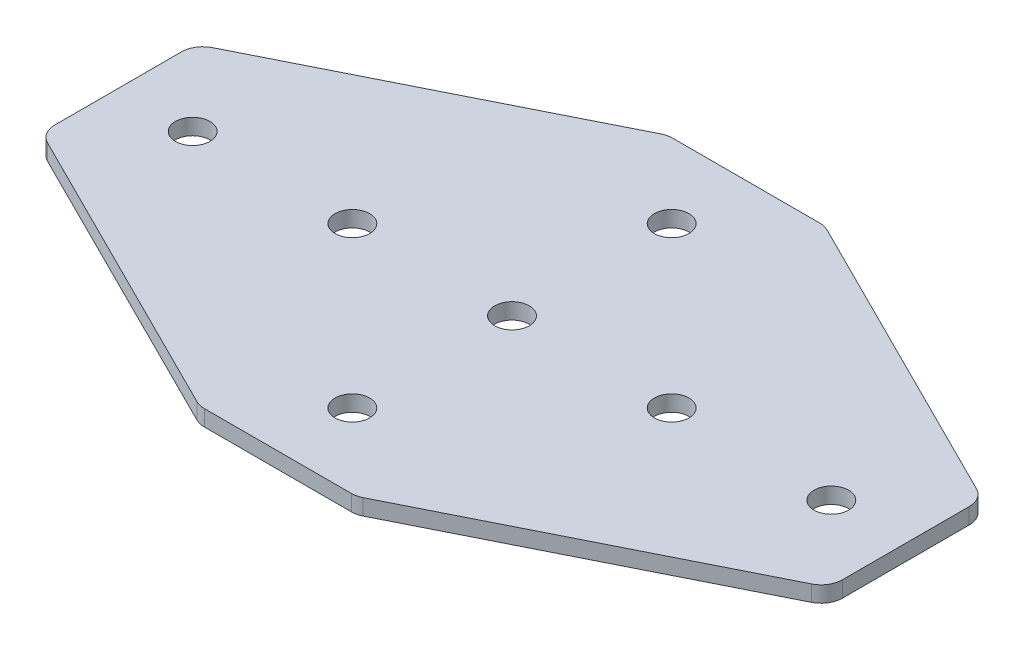
ISO-10303-21;
HEADER;
FILE_DESCRIPTION(('STEP AP214'),'2;1');
FILE_NAME('part.step','',(''),(''),'','','');
FILE_SCHEMA(('AUTOMOTIVE_DESIGN { 1 0 10303 214 1 1 1 1 }'));
ENDSEC;
DATA;
#1=APPLICATION_CONTEXT('core data for automotive mechanical design processes');
#2=APPLICATION_PROTOCOL_DEFINITION('international standard','automotive_design',2000,#1);
#3=PRODUCT_CONTEXT('',#1,'mechanical');
#4=PRODUCT('Part','Part','',(#3));
#5=PRODUCT_RELATED_PRODUCT_CATEGORY('part','',(#4));
#6=PRODUCT_DEFINITION_FORMATION('','',#4);
#7=PRODUCT_DEFINITION_CONTEXT('part definition',#1,'design');
#8=PRODUCT_DEFINITION('design','',#6,#7);
#9=PRODUCT_DEFINITION_SHAPE('','',#8);
#10=(LENGTH_UNIT() NAMED_UNIT(*) SI_UNIT(.MILLI.,.METRE.));
#11=(NAMED_UNIT(*) PLANE_ANGLE_UNIT() SI_UNIT($,.RADIAN.));
#12=(NAMED_UNIT(*) SI_UNIT($,.STERADIAN.) SOLID_ANGLE_UNIT());
#13=UNCERTAINTY_MEASURE_WITH_UNIT(LENGTH_MEASURE(1.E-05),#10,'distance_accuracy_value','');
#14=(GEOMETRIC_REPRESENTATION_CONTEXT(3) GLOBAL_UNCERTAINTY_ASSIGNED_CONTEXT((#13)) GLOBAL_UNIT_ASSIGNED_CONTEXT((#10,
#11,#12)) REPRESENTATION_CONTEXT('',''));
#15=CARTESIAN_POINT('',(0.,0.,0.));
#16=DIRECTION('',(0.,0.,1.));
#17=DIRECTION('',(1.,0.,0.));
#18=AXIS2_PLACEMENT_3D('',#15,#16,#17);
#19=CARTESIAN_POINT('',(-0.674094842111117,1.52470932668439,-1.60024481073151));
#20=DIRECTION('',(0.,-1.,0.));
#21=DIRECTION('',(0.,0.,-1.));
#22=AXIS2_PLACEMENT_3D('',#19,#20,#21);
#23=PLANE('',#22);
#24=CARTESIAN_POINT('',(-15.6740948421111,1.52470932668439,-1.6002448107315));
#25=DIRECTION('',(0.,-1.,0.));
#26=DIRECTION('',(0.,0.,1.));
#27=AXIS2_PLACEMENT_3D('',#24,#25,#26);
#28=CIRCLE('',#27,1.625);
#29=CARTESIAN_POINT('',(-15.6740948421111,1.52470932668439,0.0247551892685041));
#30=VERTEX_POINT('',#29);
#31=EDGE_CURVE('E175',#30,#30,#28,.T.);
#32=ORIENTED_EDGE('',*,*,#31,.F.);
#33=EDGE_LOOP('',(#32));
#34=FACE_BOUND('',#33,.T.);
#35=CARTESIAN_POINT('',(-30.6740948421111,1.52470932668439,-1.60024481073149));
#36=DIRECTION('',(0.,-1.,0.));
#37=DIRECTION('',(0.,0.,1.));
#38=AXIS2_PLACEMENT_3D('',#35,#36,#37);
#39=CIRCLE('',#38,1.625);
#40=CARTESIAN_POINT('',(-30.6740948421111,1.52470932668439,0.024755189268511));
#41=VERTEX_POINT('',#40);
#42=EDGE_CURVE('E168',#41,#41,#39,.T.);
#43=ORIENTED_EDGE('',*,*,#42,.F.);
#44=EDGE_LOOP('',(#43));
#45=FACE_BOUND('',#44,.T.);
#46=CARTESIAN_POINT('',(-0.674094842111117,1.52470932668439,-1.60024481073151));
#47=DIRECTION('',(0.,1.,0.));
#48=DIRECTION('',(0.,0.,1.));
#49=AXIS2_PLACEMENT_3D('',#46,#47,#48);
#50=CIRCLE('',#49,1.625);
#51=CARTESIAN_POINT('',(-0.674094842111117,1.52470932668439,0.0247551892684898));
#52=VERTEX_POINT('',#51);
#53=EDGE_CURVE('E210',#52,#52,#50,.T.);
#54=ORIENTED_EDGE('',*,*,#53,.T.);
#55=EDGE_LOOP('',(#54));
#56=FACE_BOUND('',#55,.T.);
#57=DIRECTION('',(1.,0.,0.));
#58=VECTOR('',#57,1.);
#59=CARTESIAN_POINT('',(-7.67409484211121,1.52470932668439,-23.6002448107315));
#60=LINE('',#59,#58);
#61=CARTESIAN_POINT('',(-7.58392489836175,1.52470932668439,-23.6002448107315));
#62=VERTEX_POINT('',#61);
#63=CARTESIAN_POINT('',(6.23573521413951,1.52470932668439,-23.6002448107315));
#64=VERTEX_POINT('',#63);
#65=EDGE_CURVE('E159',#62,#64,#60,.T.);
#66=ORIENTED_EDGE('',*,*,#65,.T.);
#67=CARTESIAN_POINT('',(6.23573521413951,1.52470932668439,-21.6002448107315));
#68=DIRECTION('',(0.,-1.,0.));
#69=DIRECTION('',(0.,0.,-1.));
#70=AXIS2_PLACEMENT_3D('',#67,#68,#69);
#71=CIRCLE('',#70,2.);
#72=CARTESIAN_POINT('',(7.13016240513943,1.52470932668439,-23.3890991927313));
#73=VERTEX_POINT('',#72);
#74=EDGE_CURVE('E260',#64,#73,#71,.T.);
#75=ORIENTED_EDGE('',*,*,#74,.T.);
#76=DIRECTION('',(0.894427190999916,0.,0.447213595499959));
#77=VECTOR('',#76,1.);
#78=CARTESIAN_POINT('',(6.70787116913909,1.52470932668439,-23.6002448107315));
#79=LINE('',#78,#77);
#80=CARTESIAN_POINT('',(35.2203323488887,1.52470932668439,-9.34401422085664));
#81=VERTEX_POINT('',#80);
#82=EDGE_CURVE('E151',#73,#81,#79,.T.);
#83=ORIENTED_EDGE('',*,*,#82,.T.);
#84=CARTESIAN_POINT('',(34.3259051578888,1.52470932668439,-7.55515983885681));
#85=DIRECTION('',(0.,-1.,0.));
#86=DIRECTION('',(0.,0.,-1.));
#87=AXIS2_PLACEMENT_3D('',#84,#85,#86);
#88=CIRCLE('',#87,2.);
#89=CARTESIAN_POINT('',(36.3259051578888,1.52470932668439,-7.55515983885681));
#90=VERTEX_POINT('',#89);
#91=EDGE_CURVE('E253',#81,#90,#88,.T.);
#92=ORIENTED_EDGE('',*,*,#91,.T.);
#93=DIRECTION('',(0.,0.,-1.));
#94=VECTOR('',#93,1.);
#95=CARTESIAN_POINT('',(36.3259051578888,1.52470932668439,5.59073819489358));
#96=LINE('',#95,#94);
#97=CARTESIAN_POINT('',(36.3259051578888,1.52470932668439,4.3546702173938));
#98=VERTEX_POINT('',#97);
#99=EDGE_CURVE('E223',#98,#90,#96,.T.);
#100=ORIENTED_EDGE('',*,*,#99,.F.);
#101=CARTESIAN_POINT('',(34.3259051578888,1.52470932668439,4.3546702173938));
#102=DIRECTION('',(0.,-1.,0.));
#103=DIRECTION('',(0.,0.,-1.));
#104=AXIS2_PLACEMENT_3D('',#101,#102,#103);
#105=CIRCLE('',#104,2.);
#106=CARTESIAN_POINT('',(35.2203323488887,1.52470932668439,6.14352459939363));
#107=VERTEX_POINT('',#106);
#108=EDGE_CURVE('E251',#98,#107,#105,.T.);
#109=ORIENTED_EDGE('',*,*,#108,.T.);
#110=DIRECTION('',(0.894427190999916,0.,-0.447213595499959));
#111=VECTOR('',#110,1.);
#112=CARTESIAN_POINT('',(6.70787116913909,1.52470932668439,20.3997551892685));
#113=LINE('',#112,#111);
#114=CARTESIAN_POINT('',(7.13016240513943,1.52470932668439,20.1886095712683));
#115=VERTEX_POINT('',#114);
#116=EDGE_CURVE('E219',#115,#107,#113,.T.);
#117=ORIENTED_EDGE('',*,*,#116,.F.);
#118=CARTESIAN_POINT('',(6.23573521413951,1.52470932668439,18.3997551892685));
#119=DIRECTION('',(0.,-1.,0.));
#120=DIRECTION('',(0.,0.,-1.));
#121=AXIS2_PLACEMENT_3D('',#118,#119,#120);
#122=CIRCLE('',#121,2.);
#123=CARTESIAN_POINT('',(6.23573521413951,1.52470932668439,20.3997551892685));
#124=VERTEX_POINT('',#123);
#125=EDGE_CURVE('E249',#115,#124,#122,.T.);
#126=ORIENTED_EDGE('',*,*,#125,.T.);
#127=DIRECTION('',(1.,0.,0.));
#128=VECTOR('',#127,1.);
#129=CARTESIAN_POINT('',(-7.67409484211121,1.52470932668439,20.3997551892685));
#130=LINE('',#129,#128);
#131=CARTESIAN_POINT('',(-7.58392489836175,1.52470932668439,20.3997551892685));
#132=VERTEX_POINT('',#131);
#133=EDGE_CURVE('E216',#132,#124,#130,.T.);
#134=ORIENTED_EDGE('',*,*,#133,.F.);
#135=CARTESIAN_POINT('',(-7.58392489836175,1.52470932668439,18.3997551892685));
#136=DIRECTION('',(0.,-1.,0.));
#137=DIRECTION('',(0.,0.,-1.));
#138=AXIS2_PLACEMENT_3D('',#135,#136,#137);
#139=CIRCLE('',#138,2.);
#140=CARTESIAN_POINT('',(-8.47835208936166,1.52470932668439,20.1886095712683));
#141=VERTEX_POINT('',#140);
#142=EDGE_CURVE('E247',#132,#141,#139,.T.);
#143=ORIENTED_EDGE('',*,*,#142,.T.);
#144=DIRECTION('',(-0.894427190999916,0.,-0.447213595499958));
#145=VECTOR('',#144,1.);
#146=CARTESIAN_POINT('',(-8.05606085336131,1.52470932668439,20.3997551892685));
#147=LINE('',#146,#145);
#148=CARTESIAN_POINT('',(-36.5685220331109,1.52470932668439,6.14352459939364));
#149=VERTEX_POINT('',#148);
#150=EDGE_CURVE('E181',#141,#149,#147,.T.);
#151=ORIENTED_EDGE('',*,*,#150,.T.);
#152=CARTESIAN_POINT('',(-35.674094842111,1.52470932668439,4.3546702173938));
#153=DIRECTION('',(0.,-1.,0.));
#154=DIRECTION('',(0.,0.,-1.));
#155=AXIS2_PLACEMENT_3D('',#152,#153,#154);
#156=CIRCLE('',#155,2.);
#157=CARTESIAN_POINT('',(-37.674094842111,1.52470932668439,4.35467021739381));
#158=VERTEX_POINT('',#157);
#159=EDGE_CURVE('E255',#149,#158,#156,.T.);
#160=ORIENTED_EDGE('',*,*,#159,.T.);
#161=DIRECTION('',(0.,0.,-1.));
#162=VECTOR('',#161,1.);
#163=CARTESIAN_POINT('',(-37.674094842111,1.52470932668439,5.59073819489359));
#164=LINE('',#163,#162);
#165=CARTESIAN_POINT('',(-37.674094842111,1.52470932668439,-7.55515983885682));
#166=VERTEX_POINT('',#165);
#167=EDGE_CURVE('E184',#158,#166,#164,.T.);
#168=ORIENTED_EDGE('',*,*,#167,.T.);
#169=CARTESIAN_POINT('',(-35.674094842111,1.52470932668439,-7.55515983885682));
#170=DIRECTION('',(0.,-1.,0.));
#171=DIRECTION('',(0.,0.,-1.));
#172=AXIS2_PLACEMENT_3D('',#169,#170,#171);
#173=CIRCLE('',#172,2.);
#174=CARTESIAN_POINT('',(-36.568522033111,1.52470932668439,-9.34401422085665));
#175=VERTEX_POINT('',#174);
#176=EDGE_CURVE('E31',#166,#175,#173,.T.);
#177=ORIENTED_EDGE('',*,*,#176,.T.);
#178=DIRECTION('',(-0.894427190999916,0.,0.447213595499958));
#179=VECTOR('',#178,1.);
#180=CARTESIAN_POINT('',(-8.05606085336131,1.52470932668439,-23.6002448107315));
#181=LINE('',#180,#179);
#182=CARTESIAN_POINT('',(-8.47835208936166,1.52470932668439,-23.3890991927313));
#183=VERTEX_POINT('',#182);
#184=EDGE_CURVE('E317',#183,#175,#181,.T.);
#185=ORIENTED_EDGE('',*,*,#184,.F.);
#186=CARTESIAN_POINT('',(-7.58392489836175,1.52470932668439,-21.6002448107315));
#187=DIRECTION('',(0.,-1.,0.));
#188=DIRECTION('',(0.,0.,-1.));
#189=AXIS2_PLACEMENT_3D('',#186,#187,#188);
#190=CIRCLE('',#189,2.);
#191=EDGE_CURVE('E258',#183,#62,#190,.T.);
#192=ORIENTED_EDGE('',*,*,#191,.T.);
#193=EDGE_LOOP('',(#66,#75,#83,#92,#100,#109,#117,#126,#134,#143,#151,#160,#168,#177,#185,#192));
#194=FACE_BOUND('',#193,.T.);
#195=CARTESIAN_POINT('',(29.3259051578889,1.52470932668439,-1.6002448107315));
#196=DIRECTION('',(0.,1.,0.));
#197=DIRECTION('',(0.,0.,1.));
#198=AXIS2_PLACEMENT_3D('',#195,#196,#197);
#199=CIRCLE('',#198,1.625);
#200=CARTESIAN_POINT('',(29.3259051578889,1.52470932668439,0.0247551892685039));
#201=VERTEX_POINT('',#200);
#202=EDGE_CURVE('E192',#201,#201,#199,.T.);
#203=ORIENTED_EDGE('',*,*,#202,.T.);
#204=EDGE_LOOP('',(#203));
#205=FACE_BOUND('',#204,.T.);
#206=CARTESIAN_POINT('',(-0.674094842111127,1.52470932668439,13.3997551892685));
#207=DIRECTION('',(0.,1.,0.));
#208=DIRECTION('',(0.,0.,1.));
#209=AXIS2_PLACEMENT_3D('',#206,#207,#208);
#210=CIRCLE('',#209,1.625);
#211=CARTESIAN_POINT('',(-0.674094842111127,1.52470932668439,15.0247551892685));
#212=VERTEX_POINT('',#211);
#213=EDGE_CURVE('E198',#212,#212,#210,.T.);
#214=ORIENTED_EDGE('',*,*,#213,.T.);
#215=EDGE_LOOP('',(#214));
#216=FACE_BOUND('',#215,.T.);
#217=CARTESIAN_POINT('',(14.3259051578889,1.52470932668439,-1.6002448107315));
#218=DIRECTION('',(0.,1.,0.));
#219=DIRECTION('',(0.,0.,1.));
#220=AXIS2_PLACEMENT_3D('',#217,#218,#219);
#221=CIRCLE('',#220,1.625);
#222=CARTESIAN_POINT('',(14.3259051578889,1.52470932668439,0.0247551892685004));
#223=VERTEX_POINT('',#222);
#224=EDGE_CURVE('E204',#223,#223,#221,.T.);
#225=ORIENTED_EDGE('',*,*,#224,.T.);
#226=EDGE_LOOP('',(#225));
#227=FACE_BOUND('',#226,.T.);
#228=CARTESIAN_POINT('',(-0.674094842111127,1.52470932668439,-16.6002448107315));
#229=DIRECTION('',(0.,-1.,0.));
#230=DIRECTION('',(0.,0.,-1.));
#231=AXIS2_PLACEMENT_3D('',#228,#229,#230);
#232=CIRCLE('',#231,1.625);
#233=CARTESIAN_POINT('',(-0.674094842111127,1.52470932668439,-18.2252448107315));
#234=VERTEX_POINT('',#233);
#235=EDGE_CURVE('E164',#234,#234,#232,.T.);
#236=ORIENTED_EDGE('',*,*,#235,.F.);
#237=EDGE_LOOP('',(#236));
#238=FACE_BOUND('',#237,.T.);
#239=ADVANCED_FACE('F16',(#34,#45,#56,#194,#205,#216,#227,#238),#23,.T.);
#240=CARTESIAN_POINT('',(36.3259051578888,1.52470932668439,5.59073819489358));
#241=DIRECTION('',(1.,0.,0.));
#242=DIRECTION('',(0.,0.,-1.));
#243=AXIS2_PLACEMENT_3D('',#240,#241,#242);
#244=PLANE('',#243);
#245=ORIENTED_EDGE('',*,*,#99,.T.);
#246=DIRECTION('',(0.,1.,0.));
#247=VECTOR('',#246,1.);
#248=CARTESIAN_POINT('',(36.3259051578888,1.52470932668439,-7.55515983885681));
#249=LINE('',#248,#247);
#250=CARTESIAN_POINT('',(36.3259051578888,3.02470932668439,-7.55515983885681));
#251=VERTEX_POINT('',#250);
#252=EDGE_CURVE('E278',#90,#251,#249,.T.);
#253=ORIENTED_EDGE('',*,*,#252,.T.);
#254=DIRECTION('',(0.,0.,-1.));
#255=VECTOR('',#254,1.);
#256=CARTESIAN_POINT('',(36.3259051578888,3.02470932668439,5.59073819489358));
#257=LINE('',#256,#255);
#258=CARTESIAN_POINT('',(36.3259051578888,3.02470932668439,4.3546702173938));
#259=VERTEX_POINT('',#258);
#260=EDGE_CURVE('E220',#259,#251,#257,.T.);
#261=ORIENTED_EDGE('',*,*,#260,.F.);
#262=DIRECTION('',(0.,1.,0.));
#263=VECTOR('',#262,1.);
#264=CARTESIAN_POINT('',(36.3259051578888,1.52470932668439,4.3546702173938));
#265=LINE('',#264,#263);
#266=EDGE_CURVE('E276',#259,#98,#265,.F.);
#267=ORIENTED_EDGE('',*,*,#266,.T.);
#268=EDGE_LOOP('',(#245,#253,#261,#267));
#269=FACE_BOUND('',#268,.T.);
#270=ADVANCED_FACE('F332',(#269),#244,.T.);
#271=CARTESIAN_POINT('',(-0.674094842111117,3.02470932668439,-1.60024481073151));
#272=DIRECTION('',(0.,-1.,0.));
#273=DIRECTION('',(0.,0.,-1.));
#274=AXIS2_PLACEMENT_3D('',#271,#272,#273);
#275=PLANE('',#274);
#276=CARTESIAN_POINT('',(-15.6740948421111,3.02470932668439,-1.6002448107315));
#277=DIRECTION('',(0.,-1.,0.));
#278=DIRECTION('',(0.,0.,1.));
#279=AXIS2_PLACEMENT_3D('',#276,#277,#278);
#280=CIRCLE('',#279,1.625);
#281=CARTESIAN_POINT('',(-15.6740948421111,3.02470932668439,0.0247551892685041));
#282=VERTEX_POINT('',#281);
#283=EDGE_CURVE('E171',#282,#282,#280,.T.);
#284=ORIENTED_EDGE('',*,*,#283,.T.);
#285=EDGE_LOOP('',(#284));
#286=FACE_BOUND('',#285,.T.);
#287=CARTESIAN_POINT('',(-30.6740948421111,3.02470932668439,-1.60024481073149));
#288=DIRECTION('',(0.,-1.,0.));
#289=DIRECTION('',(0.,0.,1.));
#290=AXIS2_PLACEMENT_3D('',#287,#288,#289);
#291=CIRCLE('',#290,1.625);
#292=CARTESIAN_POINT('',(-30.6740948421111,3.02470932668439,0.024755189268511));
#293=VERTEX_POINT('',#292);
#294=EDGE_CURVE('E172',#293,#293,#291,.T.);
#295=ORIENTED_EDGE('',*,*,#294,.T.);
#296=EDGE_LOOP('',(#295));
#297=FACE_BOUND('',#296,.T.);
#298=CARTESIAN_POINT('',(-0.674094842111117,3.02470932668439,-1.60024481073151));
#299=DIRECTION('',(0.,1.,0.));
#300=DIRECTION('',(0.,0.,1.));
#301=AXIS2_PLACEMENT_3D('',#298,#299,#300);
#302=CIRCLE('',#301,1.625);
#303=CARTESIAN_POINT('',(-0.674094842111117,3.02470932668439,0.0247551892684898));
#304=VERTEX_POINT('',#303);
#305=EDGE_CURVE('E207',#304,#304,#302,.T.);
#306=ORIENTED_EDGE('',*,*,#305,.F.);
#307=EDGE_LOOP('',(#306));
#308=FACE_BOUND('',#307,.T.);
#309=DIRECTION('',(0.894427190999916,0.,0.447213595499959));
#310=VECTOR('',#309,1.);
#311=CARTESIAN_POINT('',(6.70787116913909,3.02470932668439,-23.6002448107315));
#312=LINE('',#311,#310);
#313=CARTESIAN_POINT('',(7.13016240513943,3.02470932668439,-23.3890991927313));
#314=VERTEX_POINT('',#313);
#315=CARTESIAN_POINT('',(35.2203323488887,3.02470932668439,-9.34401422085664));
#316=VERTEX_POINT('',#315);
#317=EDGE_CURVE('E148',#314,#316,#312,.T.);
#318=ORIENTED_EDGE('',*,*,#317,.F.);
#319=CARTESIAN_POINT('',(6.23573521413951,3.02470932668439,-21.6002448107315));
#320=DIRECTION('',(0.,-1.,0.));
#321=DIRECTION('',(0.,0.,-1.));
#322=AXIS2_PLACEMENT_3D('',#319,#320,#321);
#323=CIRCLE('',#322,2.);
#324=CARTESIAN_POINT('',(6.23573521413951,3.02470932668439,-23.6002448107315));
#325=VERTEX_POINT('',#324);
#326=EDGE_CURVE('E131',#314,#325,#323,.F.);
#327=ORIENTED_EDGE('',*,*,#326,.T.);
#328=DIRECTION('',(1.,0.,0.));
#329=VECTOR('',#328,1.);
#330=CARTESIAN_POINT('',(-7.67409484211121,3.02470932668439,-23.6002448107315));
#331=LINE('',#330,#329);
#332=CARTESIAN_POINT('',(-7.58392489836175,3.02470932668439,-23.6002448107315));
#333=VERTEX_POINT('',#332);
#334=EDGE_CURVE('E160',#333,#325,#331,.T.);
#335=ORIENTED_EDGE('',*,*,#334,.F.);
#336=CARTESIAN_POINT('',(-7.58392489836175,3.02470932668439,-21.6002448107315));
#337=DIRECTION('',(0.,-1.,0.));
#338=DIRECTION('',(0.,0.,-1.));
#339=AXIS2_PLACEMENT_3D('',#336,#337,#338);
#340=CIRCLE('',#339,2.);
#341=CARTESIAN_POINT('',(-8.47835208936166,3.02470932668439,-23.3890991927313));
#342=VERTEX_POINT('',#341);
#343=EDGE_CURVE('E142',#333,#342,#340,.F.);
#344=ORIENTED_EDGE('',*,*,#343,.T.);
#345=DIRECTION('',(-0.894427190999916,0.,0.447213595499958));
#346=VECTOR('',#345,1.);
#347=CARTESIAN_POINT('',(-8.05606085336131,3.02470932668439,-23.6002448107315));
#348=LINE('',#347,#346);
#349=CARTESIAN_POINT('',(-36.568522033111,3.02470932668439,-9.34401422085665));
#350=VERTEX_POINT('',#349);
#351=EDGE_CURVE('E316',#342,#350,#348,.T.);
#352=ORIENTED_EDGE('',*,*,#351,.T.);
#353=CARTESIAN_POINT('',(-35.674094842111,3.02470932668439,-7.55515983885682));
#354=DIRECTION('',(0.,-1.,0.));
#355=DIRECTION('',(0.,0.,-1.));
#356=AXIS2_PLACEMENT_3D('',#353,#354,#355);
#357=CIRCLE('',#356,2.);
#358=CARTESIAN_POINT('',(-37.674094842111,3.02470932668439,-7.55515983885682));
#359=VERTEX_POINT('',#358);
#360=EDGE_CURVE('E241',#350,#359,#357,.F.);
#361=ORIENTED_EDGE('',*,*,#360,.T.);
#362=DIRECTION('',(0.,0.,-1.));
#363=VECTOR('',#362,1.);
#364=CARTESIAN_POINT('',(-37.674094842111,3.02470932668439,5.59073819489359));
#365=LINE('',#364,#363);
#366=CARTESIAN_POINT('',(-37.674094842111,3.02470932668439,4.35467021739381));
#367=VERTEX_POINT('',#366);
#368=EDGE_CURVE('E185',#367,#359,#365,.T.);
#369=ORIENTED_EDGE('',*,*,#368,.F.);
#370=CARTESIAN_POINT('',(-35.674094842111,3.02470932668439,4.3546702173938));
#371=DIRECTION('',(0.,-1.,0.));
#372=DIRECTION('',(0.,0.,-1.));
#373=AXIS2_PLACEMENT_3D('',#370,#371,#372);
#374=CIRCLE('',#373,2.);
#375=CARTESIAN_POINT('',(-36.5685220331109,3.02470932668439,6.14352459939364));
#376=VERTEX_POINT('',#375);
#377=EDGE_CURVE('E239',#367,#376,#374,.F.);
#378=ORIENTED_EDGE('',*,*,#377,.T.);
#379=DIRECTION('',(-0.894427190999916,0.,-0.447213595499958));
#380=VECTOR('',#379,1.);
#381=CARTESIAN_POINT('',(-8.05606085336131,3.02470932668439,20.3997551892685));
#382=LINE('',#381,#380);
#383=CARTESIAN_POINT('',(-8.47835208936166,3.02470932668439,20.1886095712683));
#384=VERTEX_POINT('',#383);
#385=EDGE_CURVE('E178',#384,#376,#382,.T.);
#386=ORIENTED_EDGE('',*,*,#385,.F.);
#387=CARTESIAN_POINT('',(-7.58392489836175,3.02470932668439,18.3997551892685));
#388=DIRECTION('',(0.,-1.,0.));
#389=DIRECTION('',(0.,0.,-1.));
#390=AXIS2_PLACEMENT_3D('',#387,#388,#389);
#391=CIRCLE('',#390,2.);
#392=CARTESIAN_POINT('',(-7.58392489836175,3.02470932668439,20.3997551892685));
#393=VERTEX_POINT('',#392);
#394=EDGE_CURVE('E152',#384,#393,#391,.F.);
#395=ORIENTED_EDGE('',*,*,#394,.T.);
#396=DIRECTION('',(1.,0.,0.));
#397=VECTOR('',#396,1.);
#398=CARTESIAN_POINT('',(-7.67409484211121,3.02470932668439,20.3997551892685));
#399=LINE('',#398,#397);
#400=CARTESIAN_POINT('',(6.23573521413951,3.02470932668439,20.3997551892685));
#401=VERTEX_POINT('',#400);
#402=EDGE_CURVE('E213',#393,#401,#399,.T.);
#403=ORIENTED_EDGE('',*,*,#402,.T.);
#404=CARTESIAN_POINT('',(6.23573521413951,3.02470932668439,18.3997551892685));
#405=DIRECTION('',(0.,-1.,0.));
#406=DIRECTION('',(0.,0.,-1.));
#407=AXIS2_PLACEMENT_3D('',#404,#405,#406);
#408=CIRCLE('',#407,2.);
#409=CARTESIAN_POINT('',(7.13016240513943,3.02470932668439,20.1886095712683));
#410=VERTEX_POINT('',#409);
#411=EDGE_CURVE('E234',#401,#410,#408,.F.);
#412=ORIENTED_EDGE('',*,*,#411,.T.);
#413=DIRECTION('',(0.894427190999916,0.,-0.447213595499959));
#414=VECTOR('',#413,1.);
#415=CARTESIAN_POINT('',(6.70787116913909,3.02470932668439,20.3997551892685));
#416=LINE('',#415,#414);
#417=CARTESIAN_POINT('',(35.2203323488887,3.02470932668439,6.14352459939363));
#418=VERTEX_POINT('',#417);
#419=EDGE_CURVE('E228',#410,#418,#416,.T.);
#420=ORIENTED_EDGE('',*,*,#419,.T.);
#421=CARTESIAN_POINT('',(34.3259051578888,3.02470932668439,4.3546702173938));
#422=DIRECTION('',(0.,-1.,0.));
#423=DIRECTION('',(0.,0.,-1.));
#424=AXIS2_PLACEMENT_3D('',#421,#422,#423);
#425=CIRCLE('',#424,2.);
#426=EDGE_CURVE('E236',#418,#259,#425,.F.);
#427=ORIENTED_EDGE('',*,*,#426,.T.);
#428=ORIENTED_EDGE('',*,*,#260,.T.);
#429=CARTESIAN_POINT('',(34.3259051578888,3.02470932668439,-7.55515983885681));
#430=DIRECTION('',(0.,-1.,0.));
#431=DIRECTION('',(0.,0.,-1.));
#432=AXIS2_PLACEMENT_3D('',#429,#430,#431);
#433=CIRCLE('',#432,2.);
#434=EDGE_CURVE('E158',#251,#316,#433,.F.);
#435=ORIENTED_EDGE('',*,*,#434,.T.);
#436=EDGE_LOOP('',(#318,#327,#335,#344,#352,#361,#369,#378,#386,#395,#403,#412,#420,#427,#428,#435));
#437=FACE_BOUND('',#436,.T.);
#438=CARTESIAN_POINT('',(29.3259051578889,3.02470932668439,-1.6002448107315));
#439=DIRECTION('',(0.,1.,0.));
#440=DIRECTION('',(0.,0.,1.));
#441=AXIS2_PLACEMENT_3D('',#438,#439,#440);
#442=CIRCLE('',#441,1.625);
#443=CARTESIAN_POINT('',(29.3259051578889,3.02470932668439,0.0247551892685039));
#444=VERTEX_POINT('',#443);
#445=EDGE_CURVE('E187',#444,#444,#442,.T.);
#446=ORIENTED_EDGE('',*,*,#445,.F.);
#447=EDGE_LOOP('',(#446));
#448=FACE_BOUND('',#447,.T.);
#449=CARTESIAN_POINT('',(-0.674094842111127,3.02470932668439,13.3997551892685));
#450=DIRECTION('',(0.,1.,0.));
#451=DIRECTION('',(0.,0.,1.));
#452=AXIS2_PLACEMENT_3D('',#449,#450,#451);
#453=CIRCLE('',#452,1.625);
#454=CARTESIAN_POINT('',(-0.674094842111127,3.02470932668439,15.0247551892685));
#455=VERTEX_POINT('',#454);
#456=EDGE_CURVE('E195',#455,#455,#453,.T.);
#457=ORIENTED_EDGE('',*,*,#456,.F.);
#458=EDGE_LOOP('',(#457));
#459=FACE_BOUND('',#458,.T.);
#460=CARTESIAN_POINT('',(14.3259051578889,3.02470932668439,-1.6002448107315));
#461=DIRECTION('',(0.,1.,0.));
#462=DIRECTION('',(0.,0.,1.));
#463=AXIS2_PLACEMENT_3D('',#460,#461,#462);
#464=CIRCLE('',#463,1.625);
#465=CARTESIAN_POINT('',(14.3259051578889,3.02470932668439,0.0247551892685004));
#466=VERTEX_POINT('',#465);
#467=EDGE_CURVE('E201',#466,#466,#464,.T.);
#468=ORIENTED_EDGE('',*,*,#467,.F.);
#469=EDGE_LOOP('',(#468));
#470=FACE_BOUND('',#469,.T.);
#471=CARTESIAN_POINT('',(-0.674094842111127,3.02470932668439,-16.6002448107315));
#472=DIRECTION('',(0.,-1.,0.));
#473=DIRECTION('',(0.,0.,-1.));
#474=AXIS2_PLACEMENT_3D('',#471,#472,#473);
#475=CIRCLE('',#474,1.625);
#476=CARTESIAN_POINT('',(-0.674094842111127,3.02470932668439,-18.2252448107315));
#477=VERTEX_POINT('',#476);
#478=EDGE_CURVE('E319',#477,#477,#475,.T.);
#479=ORIENTED_EDGE('',*,*,#478,.T.);
#480=EDGE_LOOP('',(#479));
#481=FACE_BOUND('',#480,.T.);
#482=ADVANCED_FACE('F155',(#286,#297,#308,#437,#448,#459,#470,#481),#275,.F.);
#483=CARTESIAN_POINT('',(-0.674094842111117,1.52470932668439,-1.60024481073151));
#484=DIRECTION('',(0.,1.,0.));
#485=DIRECTION('',(0.,0.,1.));
#486=AXIS2_PLACEMENT_3D('',#483,#484,#485);
#487=CYLINDRICAL_SURFACE('',#486,1.625);
#488=ORIENTED_EDGE('',*,*,#53,.F.);
#489=EDGE_LOOP('',(#488));
#490=FACE_BOUND('',#489,.T.);
#491=ORIENTED_EDGE('',*,*,#305,.T.);
#492=EDGE_LOOP('',(#491));
#493=FACE_BOUND('',#492,.T.);
#494=ADVANCED_FACE('F526',(#490,#493),#487,.F.);
#495=CARTESIAN_POINT('',(14.3259051578889,1.52470932668439,-1.6002448107315));
#496=DIRECTION('',(0.,1.,0.));
#497=DIRECTION('',(0.,0.,1.));
#498=AXIS2_PLACEMENT_3D('',#495,#496,#497);
#499=CYLINDRICAL_SURFACE('',#498,1.625);
#500=ORIENTED_EDGE('',*,*,#467,.T.);
#501=EDGE_LOOP('',(#500));
#502=FACE_BOUND('',#501,.T.);
#503=ORIENTED_EDGE('',*,*,#224,.F.);
#504=EDGE_LOOP('',(#503));
#505=FACE_BOUND('',#504,.T.);
#506=ADVANCED_FACE('F517',(#502,#505),#499,.F.);
#507=CARTESIAN_POINT('',(29.3259051578889,1.52470932668439,-1.6002448107315));
#508=DIRECTION('',(0.,1.,0.));
#509=DIRECTION('',(0.,0.,1.));
#510=AXIS2_PLACEMENT_3D('',#507,#508,#509);
#511=CYLINDRICAL_SURFACE('',#510,1.625);
#512=ORIENTED_EDGE('',*,*,#445,.T.);
#513=EDGE_LOOP('',(#512));
#514=FACE_BOUND('',#513,.T.);
#515=ORIENTED_EDGE('',*,*,#202,.F.);
#516=EDGE_LOOP('',(#515));
#517=FACE_BOUND('',#516,.T.);
#518=ADVANCED_FACE('F509',(#514,#517),#511,.F.);
#519=CARTESIAN_POINT('',(-37.674094842111,1.52470932668439,5.59073819489359));
#520=DIRECTION('',(-1.,0.,0.));
#521=DIRECTION('',(0.,0.,-1.));
#522=AXIS2_PLACEMENT_3D('',#519,#520,#521);
#523=PLANE('',#522);
#524=ORIENTED_EDGE('',*,*,#368,.T.);
#525=DIRECTION('',(0.,1.,0.));
#526=VECTOR('',#525,1.);
#527=CARTESIAN_POINT('',(-37.674094842111,1.52470932668439,-7.55515983885682));
#528=LINE('',#527,#526);
#529=EDGE_CURVE('E269',#359,#166,#528,.F.);
#530=ORIENTED_EDGE('',*,*,#529,.T.);
#531=ORIENTED_EDGE('',*,*,#167,.F.);
#532=DIRECTION('',(0.,1.,0.));
#533=VECTOR('',#532,1.);
#534=CARTESIAN_POINT('',(-37.674094842111,1.52470932668439,4.35467021739381));
#535=LINE('',#534,#533);
#536=EDGE_CURVE('E266',#158,#367,#535,.T.);
#537=ORIENTED_EDGE('',*,*,#536,.T.);
#538=EDGE_LOOP('',(#524,#530,#531,#537));
#539=FACE_BOUND('',#538,.T.);
#540=ADVANCED_FACE('F309',(#539),#523,.T.);
#541=CARTESIAN_POINT('',(-15.6740948421111,1.52470932668439,-1.6002448107315));
#542=DIRECTION('',(0.,1.,0.));
#543=DIRECTION('',(0.,0.,1.));
#544=AXIS2_PLACEMENT_3D('',#541,#542,#543);
#545=CYLINDRICAL_SURFACE('',#544,1.625);
#546=ORIENTED_EDGE('',*,*,#31,.T.);
#547=EDGE_LOOP('',(#546));
#548=FACE_BOUND('',#547,.T.);
#549=ORIENTED_EDGE('',*,*,#283,.F.);
#550=EDGE_LOOP('',(#549));
#551=FACE_BOUND('',#550,.T.);
#552=ADVANCED_FACE('F492',(#548,#551),#545,.F.);
#553=CARTESIAN_POINT('',(-30.6740948421111,1.52470932668439,-1.60024481073149));
#554=DIRECTION('',(0.,1.,0.));
#555=DIRECTION('',(0.,0.,1.));
#556=AXIS2_PLACEMENT_3D('',#553,#554,#555);
#557=CYLINDRICAL_SURFACE('',#556,1.625);
#558=ORIENTED_EDGE('',*,*,#294,.F.);
#559=EDGE_LOOP('',(#558));
#560=FACE_BOUND('',#559,.T.);
#561=ORIENTED_EDGE('',*,*,#42,.T.);
#562=EDGE_LOOP('',(#561));
#563=FACE_BOUND('',#562,.T.);
#564=ADVANCED_FACE('F484',(#560,#563),#557,.F.);
#565=CARTESIAN_POINT('',(6.70787116913909,1.52470932668439,20.3997551892685));
#566=DIRECTION('',(0.447213595499958,0.,0.894427190999916));
#567=DIRECTION('',(0.894427190999916,0.,-0.447213595499959));
#568=AXIS2_PLACEMENT_3D('',#565,#566,#567);
#569=PLANE('',#568);
#570=ORIENTED_EDGE('',*,*,#116,.T.);
#571=DIRECTION('',(0.,1.,0.));
#572=VECTOR('',#571,1.);
#573=CARTESIAN_POINT('',(35.2203323488887,1.52470932668439,6.14352459939363));
#574=LINE('',#573,#572);
#575=EDGE_CURVE('E283',#107,#418,#574,.T.);
#576=ORIENTED_EDGE('',*,*,#575,.T.);
#577=ORIENTED_EDGE('',*,*,#419,.F.);
#578=DIRECTION('',(0.,1.,0.));
#579=VECTOR('',#578,1.);
#580=CARTESIAN_POINT('',(7.13016240513943,1.52470932668439,20.1886095712683));
#581=LINE('',#580,#579);
#582=EDGE_CURVE('E281',#410,#115,#581,.F.);
#583=ORIENTED_EDGE('',*,*,#582,.T.);
#584=EDGE_LOOP('',(#570,#576,#577,#583));
#585=FACE_BOUND('',#584,.T.);
#586=ADVANCED_FACE('F340',(#585),#569,.T.);
#587=CARTESIAN_POINT('',(-7.67409484211121,1.52470932668439,20.3997551892685));
#588=DIRECTION('',(0.,0.,1.));
#589=DIRECTION('',(1.,0.,0.));
#590=AXIS2_PLACEMENT_3D('',#587,#588,#589);
#591=PLANE('',#590);
#592=ORIENTED_EDGE('',*,*,#133,.T.);
#593=DIRECTION('',(0.,1.,0.));
#594=VECTOR('',#593,1.);
#595=CARTESIAN_POINT('',(6.23573521413951,1.52470932668439,20.3997551892685));
#596=LINE('',#595,#594);
#597=EDGE_CURVE('E10',#124,#401,#596,.T.);
#598=ORIENTED_EDGE('',*,*,#597,.T.);
#599=ORIENTED_EDGE('',*,*,#402,.F.);
#600=DIRECTION('',(0.,1.,0.));
#601=VECTOR('',#600,1.);
#602=CARTESIAN_POINT('',(-7.58392489836175,1.52470932668439,20.3997551892685));
#603=LINE('',#602,#601);
#604=EDGE_CURVE('E24',#393,#132,#603,.F.);
#605=ORIENTED_EDGE('',*,*,#604,.T.);
#606=EDGE_LOOP('',(#592,#598,#599,#605));
#607=FACE_BOUND('',#606,.T.);
#608=ADVANCED_FACE('F289',(#607),#591,.T.);
#609=CARTESIAN_POINT('',(-0.674094842111127,1.52470932668439,13.3997551892685));
#610=DIRECTION('',(0.,1.,0.));
#611=DIRECTION('',(0.,0.,1.));
#612=AXIS2_PLACEMENT_3D('',#609,#610,#611);
#613=CYLINDRICAL_SURFACE('',#612,1.625);
#614=ORIENTED_EDGE('',*,*,#456,.T.);
#615=EDGE_LOOP('',(#614));
#616=FACE_BOUND('',#615,.T.);
#617=ORIENTED_EDGE('',*,*,#213,.F.);
#618=EDGE_LOOP('',(#617));
#619=FACE_BOUND('',#618,.T.);
#620=ADVANCED_FACE('F462',(#616,#619),#613,.F.);
#621=CARTESIAN_POINT('',(-8.05606085336131,1.52470932668439,20.3997551892685));
#622=DIRECTION('',(-0.447213595499958,0.,0.894427190999916));
#623=DIRECTION('',(-0.894427190999916,0.,-0.447213595499958));
#624=AXIS2_PLACEMENT_3D('',#621,#622,#623);
#625=PLANE('',#624);
#626=ORIENTED_EDGE('',*,*,#385,.T.);
#627=DIRECTION('',(0.,1.,0.));
#628=VECTOR('',#627,1.);
#629=CARTESIAN_POINT('',(-36.5685220331109,1.52470932668439,6.14352459939364));
#630=LINE('',#629,#628);
#631=EDGE_CURVE('E274',#376,#149,#630,.F.);
#632=ORIENTED_EDGE('',*,*,#631,.T.);
#633=ORIENTED_EDGE('',*,*,#150,.F.);
#634=DIRECTION('',(0.,1.,0.));
#635=VECTOR('',#634,1.);
#636=CARTESIAN_POINT('',(-8.47835208936166,1.52470932668439,20.1886095712683));
#637=LINE('',#636,#635);
#638=EDGE_CURVE('E271',#141,#384,#637,.T.);
#639=ORIENTED_EDGE('',*,*,#638,.T.);
#640=EDGE_LOOP('',(#626,#632,#633,#639));
#641=FACE_BOUND('',#640,.T.);
#642=ADVANCED_FACE('F300',(#641),#625,.T.);
#643=CARTESIAN_POINT('',(6.70787116913909,1.52470932668439,-23.6002448107315));
#644=DIRECTION('',(0.447213595499958,0.,-0.894427190999916));
#645=DIRECTION('',(0.894427190999916,0.,0.447213595499959));
#646=AXIS2_PLACEMENT_3D('',#643,#644,#645);
#647=PLANE('',#646);
#648=ORIENTED_EDGE('',*,*,#82,.F.);
#649=DIRECTION('',(0.,1.,0.));
#650=VECTOR('',#649,1.);
#651=CARTESIAN_POINT('',(7.13016240513943,1.52470932668439,-23.3890991927313));
#652=LINE('',#651,#650);
#653=EDGE_CURVE('E135',#73,#314,#652,.T.);
#654=ORIENTED_EDGE('',*,*,#653,.T.);
#655=ORIENTED_EDGE('',*,*,#317,.T.);
#656=DIRECTION('',(0.,1.,0.));
#657=VECTOR('',#656,1.);
#658=CARTESIAN_POINT('',(35.2203323488887,1.52470932668439,-9.34401422085664));
#659=LINE('',#658,#657);
#660=EDGE_CURVE('E153',#316,#81,#659,.F.);
#661=ORIENTED_EDGE('',*,*,#660,.T.);
#662=EDGE_LOOP('',(#648,#654,#655,#661));
#663=FACE_BOUND('',#662,.T.);
#664=ADVANCED_FACE('F147',(#663),#647,.T.);
#665=CARTESIAN_POINT('',(-7.67409484211121,1.52470932668439,-23.6002448107315));
#666=DIRECTION('',(0.,0.,-1.));
#667=DIRECTION('',(1.,0.,0.));
#668=AXIS2_PLACEMENT_3D('',#665,#666,#667);
#669=PLANE('',#668);
#670=ORIENTED_EDGE('',*,*,#334,.T.);
#671=DIRECTION('',(0.,1.,0.));
#672=VECTOR('',#671,1.);
#673=CARTESIAN_POINT('',(6.23573521413951,1.52470932668439,-23.6002448107315));
#674=LINE('',#673,#672);
#675=EDGE_CURVE('E136',#325,#64,#674,.F.);
#676=ORIENTED_EDGE('',*,*,#675,.T.);
#677=ORIENTED_EDGE('',*,*,#65,.F.);
#678=DIRECTION('',(0.,1.,0.));
#679=VECTOR('',#678,1.);
#680=CARTESIAN_POINT('',(-7.58392489836175,1.52470932668439,-23.6002448107315));
#681=LINE('',#680,#679);
#682=EDGE_CURVE('E141',#62,#333,#681,.T.);
#683=ORIENTED_EDGE('',*,*,#682,.T.);
#684=EDGE_LOOP('',(#670,#676,#677,#683));
#685=FACE_BOUND('',#684,.T.);
#686=ADVANCED_FACE('F438',(#685),#669,.T.);
#687=CARTESIAN_POINT('',(-0.674094842111127,1.52470932668439,-16.6002448107315));
#688=DIRECTION('',(0.,1.,0.));
#689=DIRECTION('',(0.,0.,-1.));
#690=AXIS2_PLACEMENT_3D('',#687,#688,#689);
#691=CYLINDRICAL_SURFACE('',#690,1.625);
#692=ORIENTED_EDGE('',*,*,#478,.F.);
#693=EDGE_LOOP('',(#692));
#694=FACE_BOUND('',#693,.T.);
#695=ORIENTED_EDGE('',*,*,#235,.T.);
#696=EDGE_LOOP('',(#695));
#697=FACE_BOUND('',#696,.T.);
#698=ADVANCED_FACE('F430',(#694,#697),#691,.F.);
#699=CARTESIAN_POINT('',(-8.05606085336131,1.52470932668439,-23.6002448107315));
#700=DIRECTION('',(-0.447213595499958,0.,-0.894427190999916));
#701=DIRECTION('',(-0.894427190999916,0.,0.447213595499958));
#702=AXIS2_PLACEMENT_3D('',#699,#700,#701);
#703=PLANE('',#702);
#704=ORIENTED_EDGE('',*,*,#351,.F.);
#705=DIRECTION('',(0.,1.,0.));
#706=VECTOR('',#705,1.);
#707=CARTESIAN_POINT('',(-8.47835208936166,1.52470932668439,-23.3890991927313));
#708=LINE('',#707,#706);
#709=EDGE_CURVE('E38',#342,#183,#708,.F.);
#710=ORIENTED_EDGE('',*,*,#709,.T.);
#711=ORIENTED_EDGE('',*,*,#184,.T.);
#712=DIRECTION('',(0.,1.,0.));
#713=VECTOR('',#712,1.);
#714=CARTESIAN_POINT('',(-36.5685220331109,1.52470932668439,-9.34401422085665));
#715=LINE('',#714,#713);
#716=EDGE_CURVE('E262',#175,#350,#715,.T.);
#717=ORIENTED_EDGE('',*,*,#716,.T.);
#718=EDGE_LOOP('',(#704,#710,#711,#717));
#719=FACE_BOUND('',#718,.T.);
#720=ADVANCED_FACE('F315',(#719),#703,.T.);
#721=CARTESIAN_POINT('',(6.23573521413951,1.52470932668439,-21.6002448107315));
#722=DIRECTION('',(0.,1.,0.));
#723=DIRECTION('',(0.,0.,1.));
#724=AXIS2_PLACEMENT_3D('',#721,#722,#723);
#725=CYLINDRICAL_SURFACE('',#724,2.);
#726=ORIENTED_EDGE('',*,*,#74,.F.);
#727=ORIENTED_EDGE('',*,*,#675,.F.);
#728=ORIENTED_EDGE('',*,*,#326,.F.);
#729=ORIENTED_EDGE('',*,*,#653,.F.);
#730=EDGE_LOOP('',(#726,#727,#728,#729));
#731=FACE_BOUND('',#730,.T.);
#732=ADVANCED_FACE('F134',(#731),#725,.T.);
#733=CARTESIAN_POINT('',(-7.58392489836175,1.52470932668439,-21.6002448107315));
#734=DIRECTION('',(0.,1.,0.));
#735=DIRECTION('',(0.,0.,1.));
#736=AXIS2_PLACEMENT_3D('',#733,#734,#735);
#737=CYLINDRICAL_SURFACE('',#736,2.);
#738=ORIENTED_EDGE('',*,*,#191,.F.);
#739=ORIENTED_EDGE('',*,*,#709,.F.);
#740=ORIENTED_EDGE('',*,*,#343,.F.);
#741=ORIENTED_EDGE('',*,*,#682,.F.);
#742=EDGE_LOOP('',(#738,#739,#740,#741));
#743=FACE_BOUND('',#742,.T.);
#744=ADVANCED_FACE('F365',(#743),#737,.T.);
#745=CARTESIAN_POINT('',(-35.674094842111,1.52470932668439,-7.55515983885682));
#746=DIRECTION('',(0.,1.,0.));
#747=DIRECTION('',(0.,0.,1.));
#748=AXIS2_PLACEMENT_3D('',#745,#746,#747);
#749=CYLINDRICAL_SURFACE('',#748,2.);
#750=ORIENTED_EDGE('',*,*,#176,.F.);
#751=ORIENTED_EDGE('',*,*,#529,.F.);
#752=ORIENTED_EDGE('',*,*,#360,.F.);
#753=ORIENTED_EDGE('',*,*,#716,.F.);
#754=EDGE_LOOP('',(#750,#751,#752,#753));
#755=FACE_BOUND('',#754,.T.);
#756=ADVANCED_FACE('F313',(#755),#749,.T.);
#757=CARTESIAN_POINT('',(-35.674094842111,1.52470932668439,4.3546702173938));
#758=DIRECTION('',(0.,1.,0.));
#759=DIRECTION('',(0.,0.,1.));
#760=AXIS2_PLACEMENT_3D('',#757,#758,#759);
#761=CYLINDRICAL_SURFACE('',#760,2.);
#762=ORIENTED_EDGE('',*,*,#159,.F.);
#763=ORIENTED_EDGE('',*,*,#631,.F.);
#764=ORIENTED_EDGE('',*,*,#377,.F.);
#765=ORIENTED_EDGE('',*,*,#536,.F.);
#766=EDGE_LOOP('',(#762,#763,#764,#765));
#767=FACE_BOUND('',#766,.T.);
#768=ADVANCED_FACE('F306',(#767),#761,.T.);
#769=CARTESIAN_POINT('',(34.3259051578888,1.52470932668439,-7.55515983885681));
#770=DIRECTION('',(0.,1.,0.));
#771=DIRECTION('',(0.,0.,1.));
#772=AXIS2_PLACEMENT_3D('',#769,#770,#771);
#773=CYLINDRICAL_SURFACE('',#772,2.);
#774=ORIENTED_EDGE('',*,*,#91,.F.);
#775=ORIENTED_EDGE('',*,*,#660,.F.);
#776=ORIENTED_EDGE('',*,*,#434,.F.);
#777=ORIENTED_EDGE('',*,*,#252,.F.);
#778=EDGE_LOOP('',(#774,#775,#776,#777));
#779=FACE_BOUND('',#778,.T.);
#780=ADVANCED_FACE('F329',(#779),#773,.T.);
#781=CARTESIAN_POINT('',(34.3259051578888,1.52470932668439,4.3546702173938));
#782=DIRECTION('',(0.,1.,0.));
#783=DIRECTION('',(0.,0.,1.));
#784=AXIS2_PLACEMENT_3D('',#781,#782,#783);
#785=CYLINDRICAL_SURFACE('',#784,2.);
#786=ORIENTED_EDGE('',*,*,#108,.F.);
#787=ORIENTED_EDGE('',*,*,#266,.F.);
#788=ORIENTED_EDGE('',*,*,#426,.F.);
#789=ORIENTED_EDGE('',*,*,#575,.F.);
#790=EDGE_LOOP('',(#786,#787,#788,#789));
#791=FACE_BOUND('',#790,.T.);
#792=ADVANCED_FACE('F338',(#791),#785,.T.);
#793=CARTESIAN_POINT('',(6.23573521413951,1.52470932668439,18.3997551892685));
#794=DIRECTION('',(0.,1.,0.));
#795=DIRECTION('',(0.,0.,1.));
#796=AXIS2_PLACEMENT_3D('',#793,#794,#795);
#797=CYLINDRICAL_SURFACE('',#796,2.);
#798=ORIENTED_EDGE('',*,*,#125,.F.);
#799=ORIENTED_EDGE('',*,*,#582,.F.);
#800=ORIENTED_EDGE('',*,*,#411,.F.);
#801=ORIENTED_EDGE('',*,*,#597,.F.);
#802=EDGE_LOOP('',(#798,#799,#800,#801));
#803=FACE_BOUND('',#802,.T.);
#804=ADVANCED_FACE('F343',(#803),#797,.T.);
#805=CARTESIAN_POINT('',(-7.58392489836175,1.52470932668439,18.3997551892685));
#806=DIRECTION('',(0.,1.,0.));
#807=DIRECTION('',(0.,0.,1.));
#808=AXIS2_PLACEMENT_3D('',#805,#806,#807);
#809=CYLINDRICAL_SURFACE('',#808,2.);
#810=ORIENTED_EDGE('',*,*,#142,.F.);
#811=ORIENTED_EDGE('',*,*,#604,.F.);
#812=ORIENTED_EDGE('',*,*,#394,.F.);
#813=ORIENTED_EDGE('',*,*,#638,.F.);
#814=EDGE_LOOP('',(#810,#811,#812,#813));
#815=FACE_BOUND('',#814,.T.);
#816=ADVANCED_FACE('F18',(#815),#809,.T.);
#817=CLOSED_SHELL('',(#239,#270,#482,#494,#506,#518,#540,#552,#564,#586,#608,#620,#642,#664,
#686,#698,#720,#732,#744,#756,#768,#780,#792,#804,#816));
#818=MANIFOLD_SOLID_BREP('B1',#817);
#819=ADVANCED_BREP_SHAPE_REPRESENTATION('',(#18,#818),#14);
#820=SHAPE_DEFINITION_REPRESENTATION(#9,#819);
ENDSEC;
END-ISO-10303-21;
